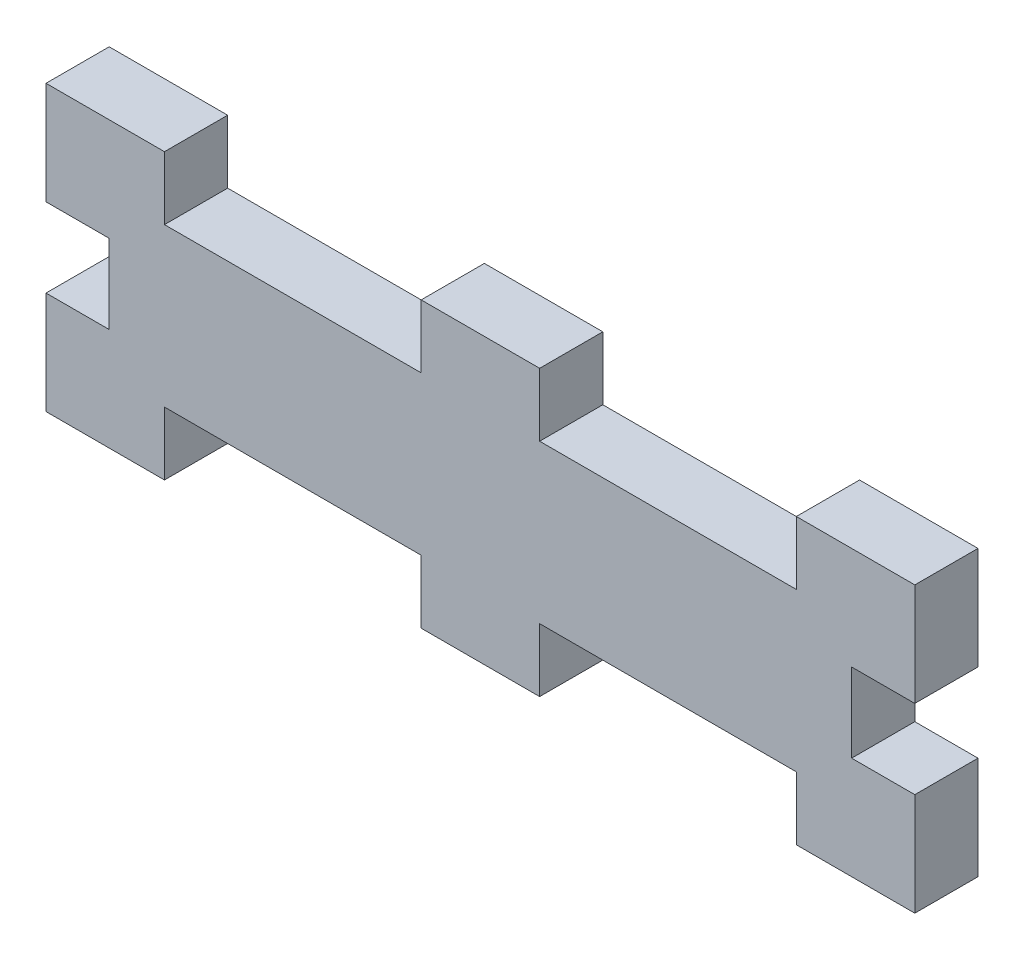
ISO-10303-21;
HEADER;
FILE_DESCRIPTION(('STEP AP214'),'2;1');
FILE_NAME('part.step','',(''),(''),'','','');
FILE_SCHEMA(('AUTOMOTIVE_DESIGN { 1 0 10303 214 1 1 1 1 }'));
ENDSEC;
DATA;
#1=APPLICATION_CONTEXT('core data for automotive mechanical design processes');
#2=APPLICATION_PROTOCOL_DEFINITION('international standard','automotive_design',2000,#1);
#3=PRODUCT_CONTEXT('',#1,'mechanical');
#4=PRODUCT('Part','Part','',(#3));
#5=PRODUCT_RELATED_PRODUCT_CATEGORY('part','',(#4));
#6=PRODUCT_DEFINITION_FORMATION('','',#4);
#7=PRODUCT_DEFINITION_CONTEXT('part definition',#1,'design');
#8=PRODUCT_DEFINITION('design','',#6,#7);
#9=PRODUCT_DEFINITION_SHAPE('','',#8);
#10=(LENGTH_UNIT() NAMED_UNIT(*) SI_UNIT(.MILLI.,.METRE.));
#11=(NAMED_UNIT(*) PLANE_ANGLE_UNIT() SI_UNIT($,.RADIAN.));
#12=(NAMED_UNIT(*) SI_UNIT($,.STERADIAN.) SOLID_ANGLE_UNIT());
#13=UNCERTAINTY_MEASURE_WITH_UNIT(LENGTH_MEASURE(1.E-05),#10,'distance_accuracy_value','');
#14=(GEOMETRIC_REPRESENTATION_CONTEXT(3) GLOBAL_UNCERTAINTY_ASSIGNED_CONTEXT((#13)) GLOBAL_UNIT_ASSIGNED_CONTEXT((#10,
#11,#12)) REPRESENTATION_CONTEXT('',''));
#15=CARTESIAN_POINT('',(0.,0.,0.));
#16=DIRECTION('',(0.,0.,1.));
#17=DIRECTION('',(1.,0.,0.));
#18=AXIS2_PLACEMENT_3D('',#15,#16,#17);
#19=CARTESIAN_POINT('',(34.925,6.35,5.08));
#20=DIRECTION('',(-1.,0.,0.));
#21=DIRECTION('',(0.,0.,1.));
#22=AXIS2_PLACEMENT_3D('',#19,#20,#21);
#23=PLANE('',#22);
#24=DIRECTION('',(0.,1.,0.));
#25=VECTOR('',#24,1.);
#26=CARTESIAN_POINT('',(34.925,6.35,0.));
#27=LINE('',#26,#25);
#28=CARTESIAN_POINT('',(34.925,-11.43,0.));
#29=VERTEX_POINT('',#28);
#30=CARTESIAN_POINT('',(34.925,-3.175,0.));
#31=VERTEX_POINT('',#30);
#32=EDGE_CURVE('E250',#29,#31,#27,.T.);
#33=ORIENTED_EDGE('',*,*,#32,.T.);
#34=DIRECTION('',(0.,0.,1.));
#35=VECTOR('',#34,1.);
#36=CARTESIAN_POINT('',(34.925,-3.175,0.));
#37=LINE('',#36,#35);
#38=CARTESIAN_POINT('',(34.925,-3.175,5.08));
#39=VERTEX_POINT('',#38);
#40=EDGE_CURVE('E400',#31,#39,#37,.T.);
#41=ORIENTED_EDGE('',*,*,#40,.T.);
#42=DIRECTION('',(0.,1.,0.));
#43=VECTOR('',#42,1.);
#44=CARTESIAN_POINT('',(34.925,6.35,5.08));
#45=LINE('',#44,#43);
#46=CARTESIAN_POINT('',(34.925,-11.43,5.08));
#47=VERTEX_POINT('',#46);
#48=EDGE_CURVE('E261',#47,#39,#45,.T.);
#49=ORIENTED_EDGE('',*,*,#48,.F.);
#50=DIRECTION('',(0.,0.,1.));
#51=VECTOR('',#50,1.);
#52=CARTESIAN_POINT('',(34.925,-11.43,0.));
#53=LINE('',#52,#51);
#54=EDGE_CURVE('E346',#29,#47,#53,.T.);
#55=ORIENTED_EDGE('',*,*,#54,.F.);
#56=EDGE_LOOP('',(#33,#41,#49,#55));
#57=FACE_BOUND('',#56,.T.);
#58=ADVANCED_FACE('F33',(#57),#23,.F.);
#59=CARTESIAN_POINT('',(-34.925,6.35,5.08));
#60=DIRECTION('',(1.,0.,0.));
#61=DIRECTION('',(0.,0.,-1.));
#62=AXIS2_PLACEMENT_3D('',#59,#60,#61);
#63=PLANE('',#62);
#64=DIRECTION('',(0.,-1.,0.));
#65=VECTOR('',#64,1.);
#66=CARTESIAN_POINT('',(-34.925,6.35,0.));
#67=LINE('',#66,#65);
#68=CARTESIAN_POINT('',(-34.925,11.43,0.));
#69=VERTEX_POINT('',#68);
#70=CARTESIAN_POINT('',(-34.925,3.175,0.));
#71=VERTEX_POINT('',#70);
#72=EDGE_CURVE('E243',#69,#71,#67,.T.);
#73=ORIENTED_EDGE('',*,*,#72,.T.);
#74=DIRECTION('',(0.,0.,1.));
#75=VECTOR('',#74,1.);
#76=CARTESIAN_POINT('',(-34.925,3.175,0.));
#77=LINE('',#76,#75);
#78=CARTESIAN_POINT('',(-34.925,3.175,5.08));
#79=VERTEX_POINT('',#78);
#80=EDGE_CURVE('E387',#71,#79,#77,.T.);
#81=ORIENTED_EDGE('',*,*,#80,.T.);
#82=DIRECTION('',(0.,-1.,0.));
#83=VECTOR('',#82,1.);
#84=CARTESIAN_POINT('',(-34.925,6.35,5.08));
#85=LINE('',#84,#83);
#86=CARTESIAN_POINT('',(-34.925,11.43,5.08));
#87=VERTEX_POINT('',#86);
#88=EDGE_CURVE('E254',#87,#79,#85,.T.);
#89=ORIENTED_EDGE('',*,*,#88,.F.);
#90=DIRECTION('',(0.,0.,1.));
#91=VECTOR('',#90,1.);
#92=CARTESIAN_POINT('',(-34.925,11.43,0.));
#93=LINE('',#92,#91);
#94=EDGE_CURVE('E271',#69,#87,#93,.T.);
#95=ORIENTED_EDGE('',*,*,#94,.F.);
#96=EDGE_LOOP('',(#73,#81,#89,#95));
#97=FACE_BOUND('',#96,.T.);
#98=ADVANCED_FACE('F435',(#97),#63,.F.);
#99=CARTESIAN_POINT('',(-34.925,-6.35,5.08));
#100=DIRECTION('',(0.,1.,0.));
#101=DIRECTION('',(0.,0.,1.));
#102=AXIS2_PLACEMENT_3D('',#99,#100,#101);
#103=PLANE('',#102);
#104=DIRECTION('',(0.,0.,1.));
#105=VECTOR('',#104,1.);
#106=CARTESIAN_POINT('',(-4.7625,-6.35,0.));
#107=LINE('',#106,#105);
#108=CARTESIAN_POINT('',(-4.7625,-6.35,0.));
#109=VERTEX_POINT('',#108);
#110=CARTESIAN_POINT('',(-4.7625,-6.35,5.08));
#111=VERTEX_POINT('',#110);
#112=EDGE_CURVE('E364',#109,#111,#107,.T.);
#113=ORIENTED_EDGE('',*,*,#112,.T.);
#114=DIRECTION('',(1.,0.,0.));
#115=VECTOR('',#114,1.);
#116=CARTESIAN_POINT('',(-34.925,-6.35,5.08));
#117=LINE('',#116,#115);
#118=CARTESIAN_POINT('',(-25.4,-6.35,5.08));
#119=VERTEX_POINT('',#118);
#120=EDGE_CURVE('E11',#119,#111,#117,.T.);
#121=ORIENTED_EDGE('',*,*,#120,.F.);
#122=DIRECTION('',(0.,0.,1.));
#123=VECTOR('',#122,1.);
#124=CARTESIAN_POINT('',(-25.4,-6.35,0.));
#125=LINE('',#124,#123);
#126=CARTESIAN_POINT('',(-25.4,-6.35,0.));
#127=VERTEX_POINT('',#126);
#128=EDGE_CURVE('E325',#127,#119,#125,.T.);
#129=ORIENTED_EDGE('',*,*,#128,.F.);
#130=DIRECTION('',(1.,0.,0.));
#131=VECTOR('',#130,1.);
#132=CARTESIAN_POINT('',(-34.925,-6.35,0.));
#133=LINE('',#132,#131);
#134=EDGE_CURVE('E37',#127,#109,#133,.T.);
#135=ORIENTED_EDGE('',*,*,#134,.T.);
#136=EDGE_LOOP('',(#113,#121,#129,#135));
#137=FACE_BOUND('',#136,.T.);
#138=ADVANCED_FACE('F506',(#137),#103,.F.);
#139=DIRECTION('',(0.,0.,1.));
#140=VECTOR('',#139,1.);
#141=CARTESIAN_POINT('',(4.7625,-6.35,0.));
#142=LINE('',#141,#140);
#143=CARTESIAN_POINT('',(4.7625,-6.35,0.));
#144=VERTEX_POINT('',#143);
#145=CARTESIAN_POINT('',(4.7625,-6.35,5.08));
#146=VERTEX_POINT('',#145);
#147=EDGE_CURVE('E375',#144,#146,#142,.T.);
#148=ORIENTED_EDGE('',*,*,#147,.F.);
#149=CARTESIAN_POINT('',(25.4,-6.35,0.));
#150=VERTEX_POINT('',#149);
#151=EDGE_CURVE('E246',#144,#150,#133,.T.);
#152=ORIENTED_EDGE('',*,*,#151,.T.);
#153=DIRECTION('',(0.,0.,1.));
#154=VECTOR('',#153,1.);
#155=CARTESIAN_POINT('',(25.4,-6.35,0.));
#156=LINE('',#155,#154);
#157=CARTESIAN_POINT('',(25.4,-6.35,5.08));
#158=VERTEX_POINT('',#157);
#159=EDGE_CURVE('E349',#150,#158,#156,.T.);
#160=ORIENTED_EDGE('',*,*,#159,.T.);
#161=EDGE_CURVE('E42',#146,#158,#117,.T.);
#162=ORIENTED_EDGE('',*,*,#161,.F.);
#163=EDGE_LOOP('',(#148,#152,#160,#162));
#164=FACE_BOUND('',#163,.T.);
#165=ADVANCED_FACE('F502',(#164),#103,.F.);
#166=CARTESIAN_POINT('',(-34.925,6.35,5.08));
#167=DIRECTION('',(0.,-1.,0.));
#168=DIRECTION('',(0.,0.,-1.));
#169=AXIS2_PLACEMENT_3D('',#166,#167,#168);
#170=PLANE('',#169);
#171=DIRECTION('',(-1.,0.,0.));
#172=VECTOR('',#171,1.);
#173=CARTESIAN_POINT('',(-34.925,6.35,5.08));
#174=LINE('',#173,#172);
#175=CARTESIAN_POINT('',(-4.7625,6.35,5.08));
#176=VERTEX_POINT('',#175);
#177=CARTESIAN_POINT('',(-25.4,6.35,5.08));
#178=VERTEX_POINT('',#177);
#179=EDGE_CURVE('E260',#176,#178,#174,.T.);
#180=ORIENTED_EDGE('',*,*,#179,.F.);
#181=DIRECTION('',(0.,0.,1.));
#182=VECTOR('',#181,1.);
#183=CARTESIAN_POINT('',(-4.7625,6.35,0.));
#184=LINE('',#183,#182);
#185=CARTESIAN_POINT('',(-4.7625,6.35,0.));
#186=VERTEX_POINT('',#185);
#187=EDGE_CURVE('E306',#186,#176,#184,.T.);
#188=ORIENTED_EDGE('',*,*,#187,.F.);
#189=DIRECTION('',(-1.,0.,0.));
#190=VECTOR('',#189,1.);
#191=CARTESIAN_POINT('',(-34.925,6.35,0.));
#192=LINE('',#191,#190);
#193=CARTESIAN_POINT('',(-25.4,6.35,0.));
#194=VERTEX_POINT('',#193);
#195=EDGE_CURVE('E247',#186,#194,#192,.T.);
#196=ORIENTED_EDGE('',*,*,#195,.T.);
#197=DIRECTION('',(0.,0.,1.));
#198=VECTOR('',#197,1.);
#199=CARTESIAN_POINT('',(-25.4,6.35,0.));
#200=LINE('',#199,#198);
#201=EDGE_CURVE('E265',#194,#178,#200,.T.);
#202=ORIENTED_EDGE('',*,*,#201,.T.);
#203=EDGE_LOOP('',(#180,#188,#196,#202));
#204=FACE_BOUND('',#203,.T.);
#205=ADVANCED_FACE('F447',(#204),#170,.F.);
#206=CARTESIAN_POINT('',(34.925,3.175,5.08));
#207=VERTEX_POINT('',#206);
#208=CARTESIAN_POINT('',(34.925,11.43,5.08));
#209=VERTEX_POINT('',#208);
#210=EDGE_CURVE('E264',#207,#209,#45,.T.);
#211=ORIENTED_EDGE('',*,*,#210,.F.);
#212=DIRECTION('',(0.,0.,1.));
#213=VECTOR('',#212,1.);
#214=CARTESIAN_POINT('',(34.925,3.175,0.));
#215=LINE('',#214,#213);
#216=CARTESIAN_POINT('',(34.925,3.175,0.));
#217=VERTEX_POINT('',#216);
#218=EDGE_CURVE('E393',#217,#207,#215,.T.);
#219=ORIENTED_EDGE('',*,*,#218,.F.);
#220=CARTESIAN_POINT('',(34.925,11.43,0.));
#221=VERTEX_POINT('',#220);
#222=EDGE_CURVE('E252',#217,#221,#27,.T.);
#223=ORIENTED_EDGE('',*,*,#222,.T.);
#224=DIRECTION('',(0.,0.,1.));
#225=VECTOR('',#224,1.);
#226=CARTESIAN_POINT('',(34.925,11.43,0.));
#227=LINE('',#226,#225);
#228=EDGE_CURVE('E286',#221,#209,#227,.T.);
#229=ORIENTED_EDGE('',*,*,#228,.T.);
#230=EDGE_LOOP('',(#211,#219,#223,#229));
#231=FACE_BOUND('',#230,.T.);
#232=ADVANCED_FACE('F35',(#231),#23,.F.);
#233=CARTESIAN_POINT('',(25.4,6.35,0.));
#234=VERTEX_POINT('',#233);
#235=CARTESIAN_POINT('',(4.7625,6.35,0.));
#236=VERTEX_POINT('',#235);
#237=EDGE_CURVE('E244',#234,#236,#192,.T.);
#238=ORIENTED_EDGE('',*,*,#237,.T.);
#239=DIRECTION('',(0.,0.,1.));
#240=VECTOR('',#239,1.);
#241=CARTESIAN_POINT('',(4.7625,6.35,0.));
#242=LINE('',#241,#240);
#243=CARTESIAN_POINT('',(4.7625,6.35,5.08));
#244=VERTEX_POINT('',#243);
#245=EDGE_CURVE('E309',#236,#244,#242,.T.);
#246=ORIENTED_EDGE('',*,*,#245,.T.);
#247=CARTESIAN_POINT('',(25.4,6.35,5.08));
#248=VERTEX_POINT('',#247);
#249=EDGE_CURVE('E257',#248,#244,#174,.T.);
#250=ORIENTED_EDGE('',*,*,#249,.F.);
#251=DIRECTION('',(0.,0.,1.));
#252=VECTOR('',#251,1.);
#253=CARTESIAN_POINT('',(25.4,6.35,0.));
#254=LINE('',#253,#252);
#255=EDGE_CURVE('E281',#234,#248,#254,.T.);
#256=ORIENTED_EDGE('',*,*,#255,.F.);
#257=EDGE_LOOP('',(#238,#246,#250,#256));
#258=FACE_BOUND('',#257,.T.);
#259=ADVANCED_FACE('F464',(#258),#170,.F.);
#260=CARTESIAN_POINT('',(-34.925,-3.175,5.08));
#261=VERTEX_POINT('',#260);
#262=CARTESIAN_POINT('',(-34.925,-11.43,5.08));
#263=VERTEX_POINT('',#262);
#264=EDGE_CURVE('E236',#261,#263,#85,.T.);
#265=ORIENTED_EDGE('',*,*,#264,.F.);
#266=DIRECTION('',(0.,0.,1.));
#267=VECTOR('',#266,1.);
#268=CARTESIAN_POINT('',(-34.925,-3.175,0.));
#269=LINE('',#268,#267);
#270=CARTESIAN_POINT('',(-34.925,-3.175,0.));
#271=VERTEX_POINT('',#270);
#272=EDGE_CURVE('E223',#271,#261,#269,.T.);
#273=ORIENTED_EDGE('',*,*,#272,.F.);
#274=CARTESIAN_POINT('',(-34.925,-11.43,0.));
#275=VERTEX_POINT('',#274);
#276=EDGE_CURVE('E234',#271,#275,#67,.T.);
#277=ORIENTED_EDGE('',*,*,#276,.T.);
#278=DIRECTION('',(0.,0.,1.));
#279=VECTOR('',#278,1.);
#280=CARTESIAN_POINT('',(-34.925,-11.43,0.));
#281=LINE('',#280,#279);
#282=EDGE_CURVE('E333',#275,#263,#281,.T.);
#283=ORIENTED_EDGE('',*,*,#282,.T.);
#284=EDGE_LOOP('',(#265,#273,#277,#283));
#285=FACE_BOUND('',#284,.T.);
#286=ADVANCED_FACE('F232',(#285),#63,.F.);
#287=CARTESIAN_POINT('',(0.,0.,5.08));
#288=DIRECTION('',(0.,0.,1.));
#289=DIRECTION('',(1.,0.,0.));
#290=AXIS2_PLACEMENT_3D('',#287,#288,#289);
#291=PLANE('',#290);
#292=DIRECTION('',(-1.,0.,0.));
#293=VECTOR('',#292,1.);
#294=CARTESIAN_POINT('',(-29.845,3.175,5.08));
#295=LINE('',#294,#293);
#296=CARTESIAN_POINT('',(-29.845,3.175,5.08));
#297=VERTEX_POINT('',#296);
#298=EDGE_CURVE('E228',#297,#79,#295,.T.);
#299=ORIENTED_EDGE('',*,*,#298,.F.);
#300=DIRECTION('',(0.,1.,0.));
#301=VECTOR('',#300,1.);
#302=CARTESIAN_POINT('',(-29.845,-3.175,5.08));
#303=LINE('',#302,#301);
#304=CARTESIAN_POINT('',(-29.845,-3.175,5.08));
#305=VERTEX_POINT('',#304);
#306=EDGE_CURVE('E424',#305,#297,#303,.T.);
#307=ORIENTED_EDGE('',*,*,#306,.F.);
#308=DIRECTION('',(1.,0.,0.));
#309=VECTOR('',#308,1.);
#310=CARTESIAN_POINT('',(-29.845,-3.175,5.08));
#311=LINE('',#310,#309);
#312=EDGE_CURVE('E403',#261,#305,#311,.T.);
#313=ORIENTED_EDGE('',*,*,#312,.F.);
#314=ORIENTED_EDGE('',*,*,#264,.T.);
#315=DIRECTION('',(-1.,0.,0.));
#316=VECTOR('',#315,1.);
#317=CARTESIAN_POINT('',(-34.925,-11.43,5.08));
#318=LINE('',#317,#316);
#319=CARTESIAN_POINT('',(-25.4,-11.43,5.08));
#320=VERTEX_POINT('',#319);
#321=EDGE_CURVE('E343',#320,#263,#318,.T.);
#322=ORIENTED_EDGE('',*,*,#321,.F.);
#323=DIRECTION('',(0.,-1.,0.));
#324=VECTOR('',#323,1.);
#325=CARTESIAN_POINT('',(-25.4,-6.35,5.08));
#326=LINE('',#325,#324);
#327=EDGE_CURVE('E341',#119,#320,#326,.T.);
#328=ORIENTED_EDGE('',*,*,#327,.F.);
#329=ORIENTED_EDGE('',*,*,#120,.T.);
#330=DIRECTION('',(0.,1.,0.));
#331=VECTOR('',#330,1.);
#332=CARTESIAN_POINT('',(-4.7625,-11.43,5.08));
#333=LINE('',#332,#331);
#334=CARTESIAN_POINT('',(-4.7625,-11.43,5.08));
#335=VERTEX_POINT('',#334);
#336=EDGE_CURVE('E384',#335,#111,#333,.T.);
#337=ORIENTED_EDGE('',*,*,#336,.F.);
#338=DIRECTION('',(-1.,0.,0.));
#339=VECTOR('',#338,1.);
#340=CARTESIAN_POINT('',(4.7625,-11.43,5.08));
#341=LINE('',#340,#339);
#342=CARTESIAN_POINT('',(4.7625,-11.43,5.08));
#343=VERTEX_POINT('',#342);
#344=EDGE_CURVE('E382',#343,#335,#341,.T.);
#345=ORIENTED_EDGE('',*,*,#344,.F.);
#346=DIRECTION('',(0.,-1.,0.));
#347=VECTOR('',#346,1.);
#348=CARTESIAN_POINT('',(4.7625,-11.43,5.08));
#349=LINE('',#348,#347);
#350=EDGE_CURVE('E379',#146,#343,#349,.T.);
#351=ORIENTED_EDGE('',*,*,#350,.F.);
#352=ORIENTED_EDGE('',*,*,#161,.T.);
#353=DIRECTION('',(0.,1.,0.));
#354=VECTOR('',#353,1.);
#355=CARTESIAN_POINT('',(25.4,-6.35,5.08));
#356=LINE('',#355,#354);
#357=CARTESIAN_POINT('',(25.4,-11.43,5.08));
#358=VERTEX_POINT('',#357);
#359=EDGE_CURVE('E361',#358,#158,#356,.T.);
#360=ORIENTED_EDGE('',*,*,#359,.F.);
#361=DIRECTION('',(-1.,0.,0.));
#362=VECTOR('',#361,1.);
#363=CARTESIAN_POINT('',(34.925,-11.43,5.08));
#364=LINE('',#363,#362);
#365=EDGE_CURVE('E358',#47,#358,#364,.T.);
#366=ORIENTED_EDGE('',*,*,#365,.F.);
#367=ORIENTED_EDGE('',*,*,#48,.T.);
#368=DIRECTION('',(1.,0.,0.));
#369=VECTOR('',#368,1.);
#370=CARTESIAN_POINT('',(29.845,-3.175,5.08));
#371=LINE('',#370,#369);
#372=CARTESIAN_POINT('',(29.845,-3.175,5.08));
#373=VERTEX_POINT('',#372);
#374=EDGE_CURVE('E404',#373,#39,#371,.T.);
#375=ORIENTED_EDGE('',*,*,#374,.F.);
#376=DIRECTION('',(0.,-1.,0.));
#377=VECTOR('',#376,1.);
#378=CARTESIAN_POINT('',(29.845,-3.175,5.08));
#379=LINE('',#378,#377);
#380=CARTESIAN_POINT('',(29.845,3.175,5.08));
#381=VERTEX_POINT('',#380);
#382=EDGE_CURVE('E407',#381,#373,#379,.T.);
#383=ORIENTED_EDGE('',*,*,#382,.F.);
#384=DIRECTION('',(-1.,0.,0.));
#385=VECTOR('',#384,1.);
#386=CARTESIAN_POINT('',(29.845,3.175,5.08));
#387=LINE('',#386,#385);
#388=EDGE_CURVE('E410',#207,#381,#387,.T.);
#389=ORIENTED_EDGE('',*,*,#388,.F.);
#390=ORIENTED_EDGE('',*,*,#210,.T.);
#391=DIRECTION('',(-1.,0.,0.));
#392=VECTOR('',#391,1.);
#393=CARTESIAN_POINT('',(34.925,11.43,5.08));
#394=LINE('',#393,#392);
#395=CARTESIAN_POINT('',(25.4,11.43,5.08));
#396=VERTEX_POINT('',#395);
#397=EDGE_CURVE('E298',#209,#396,#394,.T.);
#398=ORIENTED_EDGE('',*,*,#397,.T.);
#399=DIRECTION('',(0.,-1.,0.));
#400=VECTOR('',#399,1.);
#401=CARTESIAN_POINT('',(25.4,6.35,5.08));
#402=LINE('',#401,#400);
#403=EDGE_CURVE('E294',#396,#248,#402,.T.);
#404=ORIENTED_EDGE('',*,*,#403,.T.);
#405=ORIENTED_EDGE('',*,*,#249,.T.);
#406=DIRECTION('',(0.,1.,0.));
#407=VECTOR('',#406,1.);
#408=CARTESIAN_POINT('',(4.7625,11.43,5.08));
#409=LINE('',#408,#407);
#410=CARTESIAN_POINT('',(4.7625,11.43,5.08));
#411=VERTEX_POINT('',#410);
#412=EDGE_CURVE('E319',#244,#411,#409,.T.);
#413=ORIENTED_EDGE('',*,*,#412,.T.);
#414=DIRECTION('',(-1.,0.,0.));
#415=VECTOR('',#414,1.);
#416=CARTESIAN_POINT('',(4.7625,11.43,5.08));
#417=LINE('',#416,#415);
#418=CARTESIAN_POINT('',(-4.7625,11.43,5.08));
#419=VERTEX_POINT('',#418);
#420=EDGE_CURVE('E315',#411,#419,#417,.T.);
#421=ORIENTED_EDGE('',*,*,#420,.T.);
#422=DIRECTION('',(0.,-1.,0.));
#423=VECTOR('',#422,1.);
#424=CARTESIAN_POINT('',(-4.7625,11.43,5.08));
#425=LINE('',#424,#423);
#426=EDGE_CURVE('E322',#419,#176,#425,.T.);
#427=ORIENTED_EDGE('',*,*,#426,.T.);
#428=ORIENTED_EDGE('',*,*,#179,.T.);
#429=DIRECTION('',(0.,1.,0.));
#430=VECTOR('',#429,1.);
#431=CARTESIAN_POINT('',(-25.4,6.35,5.08));
#432=LINE('',#431,#430);
#433=CARTESIAN_POINT('',(-25.4,11.43,5.08));
#434=VERTEX_POINT('',#433);
#435=EDGE_CURVE('E278',#178,#434,#432,.T.);
#436=ORIENTED_EDGE('',*,*,#435,.T.);
#437=DIRECTION('',(-1.,0.,0.));
#438=VECTOR('',#437,1.);
#439=CARTESIAN_POINT('',(-34.925,11.43,5.08));
#440=LINE('',#439,#438);
#441=EDGE_CURVE('E274',#434,#87,#440,.T.);
#442=ORIENTED_EDGE('',*,*,#441,.T.);
#443=ORIENTED_EDGE('',*,*,#88,.T.);
#444=EDGE_LOOP('',(#299,#307,#313,#314,#322,#328,#329,#337,#345,#351,#352,#360,#366,#367,#375,
#383,#389,#390,#398,#404,#405,#413,#421,#427,#428,#436,#442,#443));
#445=FACE_BOUND('',#444,.T.);
#446=ADVANCED_FACE('F482',(#445),#291,.T.);
#447=CARTESIAN_POINT('',(0.,0.,0.));
#448=DIRECTION('',(0.,0.,1.));
#449=DIRECTION('',(1.,0.,0.));
#450=AXIS2_PLACEMENT_3D('',#447,#448,#449);
#451=PLANE('',#450);
#452=DIRECTION('',(0.,1.,0.));
#453=VECTOR('',#452,1.);
#454=CARTESIAN_POINT('',(-29.845,-3.175,0.));
#455=LINE('',#454,#453);
#456=CARTESIAN_POINT('',(-29.845,-3.175,0.));
#457=VERTEX_POINT('',#456);
#458=CARTESIAN_POINT('',(-29.845,3.175,0.));
#459=VERTEX_POINT('',#458);
#460=EDGE_CURVE('E50',#457,#459,#455,.T.);
#461=ORIENTED_EDGE('',*,*,#460,.T.);
#462=DIRECTION('',(-1.,0.,0.));
#463=VECTOR('',#462,1.);
#464=CARTESIAN_POINT('',(-29.845,3.175,0.));
#465=LINE('',#464,#463);
#466=EDGE_CURVE('E237',#459,#71,#465,.T.);
#467=ORIENTED_EDGE('',*,*,#466,.T.);
#468=ORIENTED_EDGE('',*,*,#72,.F.);
#469=DIRECTION('',(-1.,0.,0.));
#470=VECTOR('',#469,1.);
#471=CARTESIAN_POINT('',(-34.925,11.43,0.));
#472=LINE('',#471,#470);
#473=CARTESIAN_POINT('',(-25.4,11.43,0.));
#474=VERTEX_POINT('',#473);
#475=EDGE_CURVE('E269',#474,#69,#472,.T.);
#476=ORIENTED_EDGE('',*,*,#475,.F.);
#477=DIRECTION('',(0.,1.,0.));
#478=VECTOR('',#477,1.);
#479=CARTESIAN_POINT('',(-25.4,6.35,0.));
#480=LINE('',#479,#478);
#481=EDGE_CURVE('E277',#194,#474,#480,.T.);
#482=ORIENTED_EDGE('',*,*,#481,.F.);
#483=ORIENTED_EDGE('',*,*,#195,.F.);
#484=DIRECTION('',(0.,-1.,0.));
#485=VECTOR('',#484,1.);
#486=CARTESIAN_POINT('',(-4.7625,11.43,0.));
#487=LINE('',#486,#485);
#488=CARTESIAN_POINT('',(-4.7625,11.43,0.));
#489=VERTEX_POINT('',#488);
#490=EDGE_CURVE('E318',#489,#186,#487,.T.);
#491=ORIENTED_EDGE('',*,*,#490,.F.);
#492=DIRECTION('',(-1.,0.,0.));
#493=VECTOR('',#492,1.);
#494=CARTESIAN_POINT('',(4.7625,11.43,0.));
#495=LINE('',#494,#493);
#496=CARTESIAN_POINT('',(4.7625,11.43,0.));
#497=VERTEX_POINT('',#496);
#498=EDGE_CURVE('E310',#497,#489,#495,.T.);
#499=ORIENTED_EDGE('',*,*,#498,.F.);
#500=DIRECTION('',(0.,1.,0.));
#501=VECTOR('',#500,1.);
#502=CARTESIAN_POINT('',(4.7625,11.43,0.));
#503=LINE('',#502,#501);
#504=EDGE_CURVE('E328',#236,#497,#503,.T.);
#505=ORIENTED_EDGE('',*,*,#504,.F.);
#506=ORIENTED_EDGE('',*,*,#237,.F.);
#507=DIRECTION('',(0.,-1.,0.));
#508=VECTOR('',#507,1.);
#509=CARTESIAN_POINT('',(25.4,6.35,0.));
#510=LINE('',#509,#508);
#511=CARTESIAN_POINT('',(25.4,11.43,0.));
#512=VERTEX_POINT('',#511);
#513=EDGE_CURVE('E290',#512,#234,#510,.T.);
#514=ORIENTED_EDGE('',*,*,#513,.F.);
#515=DIRECTION('',(-1.,0.,0.));
#516=VECTOR('',#515,1.);
#517=CARTESIAN_POINT('',(34.925,11.43,0.));
#518=LINE('',#517,#516);
#519=EDGE_CURVE('E297',#221,#512,#518,.T.);
#520=ORIENTED_EDGE('',*,*,#519,.F.);
#521=ORIENTED_EDGE('',*,*,#222,.F.);
#522=DIRECTION('',(-1.,0.,0.));
#523=VECTOR('',#522,1.);
#524=CARTESIAN_POINT('',(29.845,3.175,0.));
#525=LINE('',#524,#523);
#526=CARTESIAN_POINT('',(29.845,3.175,0.));
#527=VERTEX_POINT('',#526);
#528=EDGE_CURVE('E406',#217,#527,#525,.T.);
#529=ORIENTED_EDGE('',*,*,#528,.T.);
#530=DIRECTION('',(0.,-1.,0.));
#531=VECTOR('',#530,1.);
#532=CARTESIAN_POINT('',(29.845,-3.175,0.));
#533=LINE('',#532,#531);
#534=CARTESIAN_POINT('',(29.845,-3.175,0.));
#535=VERTEX_POINT('',#534);
#536=EDGE_CURVE('E58',#527,#535,#533,.T.);
#537=ORIENTED_EDGE('',*,*,#536,.T.);
#538=DIRECTION('',(1.,0.,0.));
#539=VECTOR('',#538,1.);
#540=CARTESIAN_POINT('',(29.845,-3.175,0.));
#541=LINE('',#540,#539);
#542=EDGE_CURVE('E396',#535,#31,#541,.T.);
#543=ORIENTED_EDGE('',*,*,#542,.T.);
#544=ORIENTED_EDGE('',*,*,#32,.F.);
#545=DIRECTION('',(-1.,0.,0.));
#546=VECTOR('',#545,1.);
#547=CARTESIAN_POINT('',(34.925,-11.43,0.));
#548=LINE('',#547,#546);
#549=CARTESIAN_POINT('',(25.4,-11.43,0.));
#550=VERTEX_POINT('',#549);
#551=EDGE_CURVE('E353',#29,#550,#548,.T.);
#552=ORIENTED_EDGE('',*,*,#551,.T.);
#553=DIRECTION('',(0.,1.,0.));
#554=VECTOR('',#553,1.);
#555=CARTESIAN_POINT('',(25.4,-6.35,0.));
#556=LINE('',#555,#554);
#557=EDGE_CURVE('E360',#550,#150,#556,.T.);
#558=ORIENTED_EDGE('',*,*,#557,.T.);
#559=ORIENTED_EDGE('',*,*,#151,.F.);
#560=DIRECTION('',(0.,-1.,0.));
#561=VECTOR('',#560,1.);
#562=CARTESIAN_POINT('',(4.7625,-11.43,0.));
#563=LINE('',#562,#561);
#564=CARTESIAN_POINT('',(4.7625,-11.43,0.));
#565=VERTEX_POINT('',#564);
#566=EDGE_CURVE('E372',#144,#565,#563,.T.);
#567=ORIENTED_EDGE('',*,*,#566,.T.);
#568=DIRECTION('',(-1.,0.,0.));
#569=VECTOR('',#568,1.);
#570=CARTESIAN_POINT('',(4.7625,-11.43,0.));
#571=LINE('',#570,#569);
#572=CARTESIAN_POINT('',(-4.7625,-11.43,0.));
#573=VERTEX_POINT('',#572);
#574=EDGE_CURVE('E389',#565,#573,#571,.T.);
#575=ORIENTED_EDGE('',*,*,#574,.T.);
#576=DIRECTION('',(0.,1.,0.));
#577=VECTOR('',#576,1.);
#578=CARTESIAN_POINT('',(-4.7625,-11.43,0.));
#579=LINE('',#578,#577);
#580=EDGE_CURVE('E381',#573,#109,#579,.T.);
#581=ORIENTED_EDGE('',*,*,#580,.T.);
#582=ORIENTED_EDGE('',*,*,#134,.F.);
#583=DIRECTION('',(0.,-1.,0.));
#584=VECTOR('',#583,1.);
#585=CARTESIAN_POINT('',(-25.4,-6.35,0.));
#586=LINE('',#585,#584);
#587=CARTESIAN_POINT('',(-25.4,-11.43,0.));
#588=VERTEX_POINT('',#587);
#589=EDGE_CURVE('E336',#127,#588,#586,.T.);
#590=ORIENTED_EDGE('',*,*,#589,.T.);
#591=DIRECTION('',(-1.,0.,0.));
#592=VECTOR('',#591,1.);
#593=CARTESIAN_POINT('',(-34.925,-11.43,0.));
#594=LINE('',#593,#592);
#595=EDGE_CURVE('E241',#588,#275,#594,.T.);
#596=ORIENTED_EDGE('',*,*,#595,.T.);
#597=ORIENTED_EDGE('',*,*,#276,.F.);
#598=DIRECTION('',(1.,0.,0.));
#599=VECTOR('',#598,1.);
#600=CARTESIAN_POINT('',(-29.845,-3.175,0.));
#601=LINE('',#600,#599);
#602=EDGE_CURVE('E219',#271,#457,#601,.T.);
#603=ORIENTED_EDGE('',*,*,#602,.T.);
#604=EDGE_LOOP('',(#461,#467,#468,#476,#482,#483,#491,#499,#505,#506,#514,#520,#521,#529,#537,
#543,#544,#552,#558,#559,#567,#575,#581,#582,#590,#596,#597,#603));
#605=FACE_BOUND('',#604,.T.);
#606=ADVANCED_FACE('F239',(#605),#451,.F.);
#607=CARTESIAN_POINT('',(-34.925,11.43,0.));
#608=DIRECTION('',(0.,1.,0.));
#609=DIRECTION('',(0.,0.,1.));
#610=AXIS2_PLACEMENT_3D('',#607,#608,#609);
#611=PLANE('',#610);
#612=ORIENTED_EDGE('',*,*,#441,.F.);
#613=DIRECTION('',(0.,0.,1.));
#614=VECTOR('',#613,1.);
#615=CARTESIAN_POINT('',(-25.4,11.43,0.));
#616=LINE('',#615,#614);
#617=EDGE_CURVE('E268',#474,#434,#616,.T.);
#618=ORIENTED_EDGE('',*,*,#617,.F.);
#619=ORIENTED_EDGE('',*,*,#475,.T.);
#620=ORIENTED_EDGE('',*,*,#94,.T.);
#621=EDGE_LOOP('',(#612,#618,#619,#620));
#622=FACE_BOUND('',#621,.T.);
#623=ADVANCED_FACE('F438',(#622),#611,.T.);
#624=CARTESIAN_POINT('',(-25.4,6.35,0.));
#625=DIRECTION('',(1.,0.,0.));
#626=DIRECTION('',(0.,0.,-1.));
#627=AXIS2_PLACEMENT_3D('',#624,#625,#626);
#628=PLANE('',#627);
#629=ORIENTED_EDGE('',*,*,#435,.F.);
#630=ORIENTED_EDGE('',*,*,#201,.F.);
#631=ORIENTED_EDGE('',*,*,#481,.T.);
#632=ORIENTED_EDGE('',*,*,#617,.T.);
#633=EDGE_LOOP('',(#629,#630,#631,#632));
#634=FACE_BOUND('',#633,.T.);
#635=ADVANCED_FACE('F445',(#634),#628,.T.);
#636=CARTESIAN_POINT('',(25.4,6.35,0.));
#637=DIRECTION('',(-1.,0.,0.));
#638=DIRECTION('',(0.,0.,1.));
#639=AXIS2_PLACEMENT_3D('',#636,#637,#638);
#640=PLANE('',#639);
#641=ORIENTED_EDGE('',*,*,#403,.F.);
#642=DIRECTION('',(0.,0.,1.));
#643=VECTOR('',#642,1.);
#644=CARTESIAN_POINT('',(25.4,11.43,0.));
#645=LINE('',#644,#643);
#646=EDGE_CURVE('E289',#512,#396,#645,.T.);
#647=ORIENTED_EDGE('',*,*,#646,.F.);
#648=ORIENTED_EDGE('',*,*,#513,.T.);
#649=ORIENTED_EDGE('',*,*,#255,.T.);
#650=EDGE_LOOP('',(#641,#647,#648,#649));
#651=FACE_BOUND('',#650,.T.);
#652=ADVANCED_FACE('F467',(#651),#640,.T.);
#653=CARTESIAN_POINT('',(34.925,11.43,0.));
#654=DIRECTION('',(0.,1.,0.));
#655=DIRECTION('',(-1.,0.,0.));
#656=AXIS2_PLACEMENT_3D('',#653,#654,#655);
#657=PLANE('',#656);
#658=ORIENTED_EDGE('',*,*,#397,.F.);
#659=ORIENTED_EDGE('',*,*,#228,.F.);
#660=ORIENTED_EDGE('',*,*,#519,.T.);
#661=ORIENTED_EDGE('',*,*,#646,.T.);
#662=EDGE_LOOP('',(#658,#659,#660,#661));
#663=FACE_BOUND('',#662,.T.);
#664=ADVANCED_FACE('F470',(#663),#657,.T.);
#665=CARTESIAN_POINT('',(-4.7625,11.43,0.));
#666=DIRECTION('',(-1.,0.,0.));
#667=DIRECTION('',(0.,-1.,0.));
#668=AXIS2_PLACEMENT_3D('',#665,#666,#667);
#669=PLANE('',#668);
#670=ORIENTED_EDGE('',*,*,#426,.F.);
#671=DIRECTION('',(0.,0.,1.));
#672=VECTOR('',#671,1.);
#673=CARTESIAN_POINT('',(-4.7625,11.43,0.));
#674=LINE('',#673,#672);
#675=EDGE_CURVE('E301',#489,#419,#674,.T.);
#676=ORIENTED_EDGE('',*,*,#675,.F.);
#677=ORIENTED_EDGE('',*,*,#490,.T.);
#678=ORIENTED_EDGE('',*,*,#187,.T.);
#679=EDGE_LOOP('',(#670,#676,#677,#678));
#680=FACE_BOUND('',#679,.T.);
#681=ADVANCED_FACE('F450',(#680),#669,.T.);
#682=CARTESIAN_POINT('',(4.7625,11.43,0.));
#683=DIRECTION('',(0.,1.,0.));
#684=DIRECTION('',(-1.,0.,0.));
#685=AXIS2_PLACEMENT_3D('',#682,#683,#684);
#686=PLANE('',#685);
#687=ORIENTED_EDGE('',*,*,#420,.F.);
#688=DIRECTION('',(0.,0.,1.));
#689=VECTOR('',#688,1.);
#690=CARTESIAN_POINT('',(4.7625,11.43,0.));
#691=LINE('',#690,#689);
#692=EDGE_CURVE('E312',#497,#411,#691,.T.);
#693=ORIENTED_EDGE('',*,*,#692,.F.);
#694=ORIENTED_EDGE('',*,*,#498,.T.);
#695=ORIENTED_EDGE('',*,*,#675,.T.);
#696=EDGE_LOOP('',(#687,#693,#694,#695));
#697=FACE_BOUND('',#696,.T.);
#698=ADVANCED_FACE('F455',(#697),#686,.T.);
#699=CARTESIAN_POINT('',(4.7625,11.43,0.));
#700=DIRECTION('',(1.,0.,0.));
#701=DIRECTION('',(0.,0.,-1.));
#702=AXIS2_PLACEMENT_3D('',#699,#700,#701);
#703=PLANE('',#702);
#704=ORIENTED_EDGE('',*,*,#412,.F.);
#705=ORIENTED_EDGE('',*,*,#245,.F.);
#706=ORIENTED_EDGE('',*,*,#504,.T.);
#707=ORIENTED_EDGE('',*,*,#692,.T.);
#708=EDGE_LOOP('',(#704,#705,#706,#707));
#709=FACE_BOUND('',#708,.T.);
#710=ADVANCED_FACE('F459',(#709),#703,.T.);
#711=CARTESIAN_POINT('',(-25.4,-6.35,0.));
#712=DIRECTION('',(-1.,0.,0.));
#713=DIRECTION('',(0.,0.,1.));
#714=AXIS2_PLACEMENT_3D('',#711,#712,#713);
#715=PLANE('',#714);
#716=ORIENTED_EDGE('',*,*,#327,.T.);
#717=DIRECTION('',(0.,0.,1.));
#718=VECTOR('',#717,1.);
#719=CARTESIAN_POINT('',(-25.4,-11.43,0.));
#720=LINE('',#719,#718);
#721=EDGE_CURVE('E335',#588,#320,#720,.T.);
#722=ORIENTED_EDGE('',*,*,#721,.F.);
#723=ORIENTED_EDGE('',*,*,#589,.F.);
#724=ORIENTED_EDGE('',*,*,#128,.T.);
#725=EDGE_LOOP('',(#716,#722,#723,#724));
#726=FACE_BOUND('',#725,.T.);
#727=ADVANCED_FACE('F520',(#726),#715,.F.);
#728=CARTESIAN_POINT('',(-34.925,-11.43,0.));
#729=DIRECTION('',(0.,1.,0.));
#730=DIRECTION('',(0.,0.,1.));
#731=AXIS2_PLACEMENT_3D('',#728,#729,#730);
#732=PLANE('',#731);
#733=ORIENTED_EDGE('',*,*,#321,.T.);
#734=ORIENTED_EDGE('',*,*,#282,.F.);
#735=ORIENTED_EDGE('',*,*,#595,.F.);
#736=ORIENTED_EDGE('',*,*,#721,.T.);
#737=EDGE_LOOP('',(#733,#734,#735,#736));
#738=FACE_BOUND('',#737,.T.);
#739=ADVANCED_FACE('F523',(#738),#732,.F.);
#740=CARTESIAN_POINT('',(34.925,-11.43,0.));
#741=DIRECTION('',(0.,1.,0.));
#742=DIRECTION('',(-1.,0.,0.));
#743=AXIS2_PLACEMENT_3D('',#740,#741,#742);
#744=PLANE('',#743);
#745=ORIENTED_EDGE('',*,*,#365,.T.);
#746=DIRECTION('',(0.,0.,1.));
#747=VECTOR('',#746,1.);
#748=CARTESIAN_POINT('',(25.4,-11.43,0.));
#749=LINE('',#748,#747);
#750=EDGE_CURVE('E352',#550,#358,#749,.T.);
#751=ORIENTED_EDGE('',*,*,#750,.F.);
#752=ORIENTED_EDGE('',*,*,#551,.F.);
#753=ORIENTED_EDGE('',*,*,#54,.T.);
#754=EDGE_LOOP('',(#745,#751,#752,#753));
#755=FACE_BOUND('',#754,.T.);
#756=ADVANCED_FACE('F493',(#755),#744,.F.);
#757=CARTESIAN_POINT('',(25.4,-6.35,0.));
#758=DIRECTION('',(1.,0.,0.));
#759=DIRECTION('',(0.,0.,-1.));
#760=AXIS2_PLACEMENT_3D('',#757,#758,#759);
#761=PLANE('',#760);
#762=ORIENTED_EDGE('',*,*,#359,.T.);
#763=ORIENTED_EDGE('',*,*,#159,.F.);
#764=ORIENTED_EDGE('',*,*,#557,.F.);
#765=ORIENTED_EDGE('',*,*,#750,.T.);
#766=EDGE_LOOP('',(#762,#763,#764,#765));
#767=FACE_BOUND('',#766,.T.);
#768=ADVANCED_FACE('F499',(#767),#761,.F.);
#769=CARTESIAN_POINT('',(-4.7625,-11.43,0.));
#770=DIRECTION('',(1.,0.,0.));
#771=DIRECTION('',(0.,1.,0.));
#772=AXIS2_PLACEMENT_3D('',#769,#770,#771);
#773=PLANE('',#772);
#774=ORIENTED_EDGE('',*,*,#336,.T.);
#775=ORIENTED_EDGE('',*,*,#112,.F.);
#776=ORIENTED_EDGE('',*,*,#580,.F.);
#777=DIRECTION('',(0.,0.,1.));
#778=VECTOR('',#777,1.);
#779=CARTESIAN_POINT('',(-4.7625,-11.43,0.));
#780=LINE('',#779,#778);
#781=EDGE_CURVE('E368',#573,#335,#780,.T.);
#782=ORIENTED_EDGE('',*,*,#781,.T.);
#783=EDGE_LOOP('',(#774,#775,#776,#782));
#784=FACE_BOUND('',#783,.T.);
#785=ADVANCED_FACE('F513',(#784),#773,.F.);
#786=CARTESIAN_POINT('',(4.7625,-11.43,0.));
#787=DIRECTION('',(-1.,0.,0.));
#788=DIRECTION('',(0.,0.,1.));
#789=AXIS2_PLACEMENT_3D('',#786,#787,#788);
#790=PLANE('',#789);
#791=ORIENTED_EDGE('',*,*,#350,.T.);
#792=DIRECTION('',(0.,0.,1.));
#793=VECTOR('',#792,1.);
#794=CARTESIAN_POINT('',(4.7625,-11.43,0.));
#795=LINE('',#794,#793);
#796=EDGE_CURVE('E371',#565,#343,#795,.T.);
#797=ORIENTED_EDGE('',*,*,#796,.F.);
#798=ORIENTED_EDGE('',*,*,#566,.F.);
#799=ORIENTED_EDGE('',*,*,#147,.T.);
#800=EDGE_LOOP('',(#791,#797,#798,#799));
#801=FACE_BOUND('',#800,.T.);
#802=ADVANCED_FACE('F581',(#801),#790,.F.);
#803=CARTESIAN_POINT('',(4.7625,-11.43,0.));
#804=DIRECTION('',(0.,1.,0.));
#805=DIRECTION('',(-1.,0.,0.));
#806=AXIS2_PLACEMENT_3D('',#803,#804,#805);
#807=PLANE('',#806);
#808=ORIENTED_EDGE('',*,*,#344,.T.);
#809=ORIENTED_EDGE('',*,*,#781,.F.);
#810=ORIENTED_EDGE('',*,*,#574,.F.);
#811=ORIENTED_EDGE('',*,*,#796,.T.);
#812=EDGE_LOOP('',(#808,#809,#810,#811));
#813=FACE_BOUND('',#812,.T.);
#814=ADVANCED_FACE('F582',(#813),#807,.F.);
#815=CARTESIAN_POINT('',(29.845,-3.175,0.));
#816=DIRECTION('',(0.,-1.,0.));
#817=DIRECTION('',(1.,0.,0.));
#818=AXIS2_PLACEMENT_3D('',#815,#816,#817);
#819=PLANE('',#818);
#820=ORIENTED_EDGE('',*,*,#374,.T.);
#821=ORIENTED_EDGE('',*,*,#40,.F.);
#822=ORIENTED_EDGE('',*,*,#542,.F.);
#823=DIRECTION('',(0.,0.,1.));
#824=VECTOR('',#823,1.);
#825=CARTESIAN_POINT('',(29.845,-3.175,0.));
#826=LINE('',#825,#824);
#827=EDGE_CURVE('E398',#535,#373,#826,.T.);
#828=ORIENTED_EDGE('',*,*,#827,.T.);
#829=EDGE_LOOP('',(#820,#821,#822,#828));
#830=FACE_BOUND('',#829,.T.);
#831=ADVANCED_FACE('F487',(#830),#819,.F.);
#832=CARTESIAN_POINT('',(29.845,-3.175,0.));
#833=DIRECTION('',(-1.,0.,0.));
#834=DIRECTION('',(0.,0.,1.));
#835=AXIS2_PLACEMENT_3D('',#832,#833,#834);
#836=PLANE('',#835);
#837=ORIENTED_EDGE('',*,*,#382,.T.);
#838=ORIENTED_EDGE('',*,*,#827,.F.);
#839=ORIENTED_EDGE('',*,*,#536,.F.);
#840=DIRECTION('',(0.,0.,1.));
#841=VECTOR('',#840,1.);
#842=CARTESIAN_POINT('',(29.845,3.175,0.));
#843=LINE('',#842,#841);
#844=EDGE_CURVE('E395',#527,#381,#843,.T.);
#845=ORIENTED_EDGE('',*,*,#844,.T.);
#846=EDGE_LOOP('',(#837,#838,#839,#845));
#847=FACE_BOUND('',#846,.T.);
#848=ADVANCED_FACE('F484',(#847),#836,.F.);
#849=CARTESIAN_POINT('',(29.845,3.175,0.));
#850=DIRECTION('',(0.,1.,0.));
#851=DIRECTION('',(0.,0.,1.));
#852=AXIS2_PLACEMENT_3D('',#849,#850,#851);
#853=PLANE('',#852);
#854=ORIENTED_EDGE('',*,*,#388,.T.);
#855=ORIENTED_EDGE('',*,*,#844,.F.);
#856=ORIENTED_EDGE('',*,*,#528,.F.);
#857=ORIENTED_EDGE('',*,*,#218,.T.);
#858=EDGE_LOOP('',(#854,#855,#856,#857));
#859=FACE_BOUND('',#858,.T.);
#860=ADVANCED_FACE('F478',(#859),#853,.F.);
#861=CARTESIAN_POINT('',(-29.845,3.175,0.));
#862=DIRECTION('',(0.,1.,0.));
#863=DIRECTION('',(0.,0.,1.));
#864=AXIS2_PLACEMENT_3D('',#861,#862,#863);
#865=PLANE('',#864);
#866=ORIENTED_EDGE('',*,*,#298,.T.);
#867=ORIENTED_EDGE('',*,*,#80,.F.);
#868=ORIENTED_EDGE('',*,*,#466,.F.);
#869=DIRECTION('',(0.,0.,1.));
#870=VECTOR('',#869,1.);
#871=CARTESIAN_POINT('',(-29.845,3.175,0.));
#872=LINE('',#871,#870);
#873=EDGE_CURVE('E419',#459,#297,#872,.T.);
#874=ORIENTED_EDGE('',*,*,#873,.T.);
#875=EDGE_LOOP('',(#866,#867,#868,#874));
#876=FACE_BOUND('',#875,.T.);
#877=ADVANCED_FACE('F526',(#876),#865,.F.);
#878=CARTESIAN_POINT('',(-29.845,-3.175,0.));
#879=DIRECTION('',(1.,0.,0.));
#880=DIRECTION('',(0.,0.,-1.));
#881=AXIS2_PLACEMENT_3D('',#878,#879,#880);
#882=PLANE('',#881);
#883=ORIENTED_EDGE('',*,*,#306,.T.);
#884=ORIENTED_EDGE('',*,*,#873,.F.);
#885=ORIENTED_EDGE('',*,*,#460,.F.);
#886=DIRECTION('',(0.,0.,1.));
#887=VECTOR('',#886,1.);
#888=CARTESIAN_POINT('',(-29.845,-3.175,0.));
#889=LINE('',#888,#887);
#890=EDGE_CURVE('E225',#457,#305,#889,.T.);
#891=ORIENTED_EDGE('',*,*,#890,.T.);
#892=EDGE_LOOP('',(#883,#884,#885,#891));
#893=FACE_BOUND('',#892,.T.);
#894=ADVANCED_FACE('F525',(#893),#882,.F.);
#895=CARTESIAN_POINT('',(-29.845,-3.175,0.));
#896=DIRECTION('',(0.,-1.,0.));
#897=DIRECTION('',(1.,0.,0.));
#898=AXIS2_PLACEMENT_3D('',#895,#896,#897);
#899=PLANE('',#898);
#900=ORIENTED_EDGE('',*,*,#312,.T.);
#901=ORIENTED_EDGE('',*,*,#890,.F.);
#902=ORIENTED_EDGE('',*,*,#602,.F.);
#903=ORIENTED_EDGE('',*,*,#272,.T.);
#904=EDGE_LOOP('',(#900,#901,#902,#903));
#905=FACE_BOUND('',#904,.T.);
#906=ADVANCED_FACE('F222',(#905),#899,.F.);
#907=CLOSED_SHELL('',(#58,#98,#138,#165,#205,#232,#259,#286,#446,#606,#623,#635,#652,#664,#681,
#698,#710,#727,#739,#756,#768,#785,#802,#814,#831,#848,#860,#877,#894,#906));
#908=MANIFOLD_SOLID_BREP('B2',#907);
#909=ADVANCED_BREP_SHAPE_REPRESENTATION('',(#18,#908),#14);
#910=SHAPE_DEFINITION_REPRESENTATION(#9,#909);
ENDSEC;
END-ISO-10303-21;
